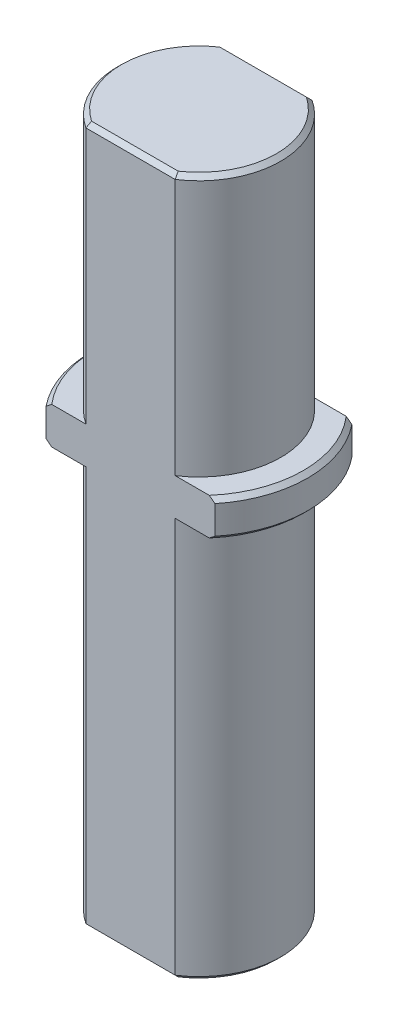
ISO-10303-21;
HEADER;
FILE_DESCRIPTION(('STEP AP214'),'2;1');
FILE_NAME('part.step','',(''),(''),'','','');
FILE_SCHEMA(('AUTOMOTIVE_DESIGN { 1 0 10303 214 1 1 1 1 }'));
ENDSEC;
DATA;
#1=APPLICATION_CONTEXT('core data for automotive mechanical design processes');
#2=APPLICATION_PROTOCOL_DEFINITION('international standard','automotive_design',2000,#1);
#3=PRODUCT_CONTEXT('',#1,'mechanical');
#4=PRODUCT('Part','Part','',(#3));
#5=PRODUCT_RELATED_PRODUCT_CATEGORY('part','',(#4));
#6=PRODUCT_DEFINITION_FORMATION('','',#4);
#7=PRODUCT_DEFINITION_CONTEXT('part definition',#1,'design');
#8=PRODUCT_DEFINITION('design','',#6,#7);
#9=PRODUCT_DEFINITION_SHAPE('','',#8);
#10=(LENGTH_UNIT() NAMED_UNIT(*) SI_UNIT(.MILLI.,.METRE.));
#11=(NAMED_UNIT(*) PLANE_ANGLE_UNIT() SI_UNIT($,.RADIAN.));
#12=(NAMED_UNIT(*) SI_UNIT($,.STERADIAN.) SOLID_ANGLE_UNIT());
#13=UNCERTAINTY_MEASURE_WITH_UNIT(LENGTH_MEASURE(1.E-05),#10,'distance_accuracy_value','');
#14=(GEOMETRIC_REPRESENTATION_CONTEXT(3) GLOBAL_UNCERTAINTY_ASSIGNED_CONTEXT((#13)) GLOBAL_UNIT_ASSIGNED_CONTEXT((#10,
#11,#12)) REPRESENTATION_CONTEXT('',''));
#15=CARTESIAN_POINT('',(0.,0.,0.));
#16=DIRECTION('',(0.,0.,1.));
#17=DIRECTION('',(1.,0.,0.));
#18=AXIS2_PLACEMENT_3D('',#15,#16,#17);
#19=CARTESIAN_POINT('',(0.,64.2,0.));
#20=DIRECTION('',(0.,-1.,0.));
#21=DIRECTION('',(0.,0.,-1.));
#22=AXIS2_PLACEMENT_3D('',#19,#20,#21);
#23=CYLINDRICAL_SURFACE('',#22,7.52);
#24=CARTESIAN_POINT('',(0.,36.8,0.));
#25=DIRECTION('',(0.,1.,0.));
#26=DIRECTION('',(0.,0.,1.));
#27=AXIS2_PLACEMENT_3D('',#24,#25,#26);
#28=CIRCLE('',#27,7.52);
#29=CARTESIAN_POINT('',(4.10614174134308,36.8,6.3));
#30=VERTEX_POINT('',#29);
#31=CARTESIAN_POINT('',(4.10614174134308,36.8,-6.3));
#32=VERTEX_POINT('',#31);
#33=EDGE_CURVE('E224',#30,#32,#28,.T.);
#34=ORIENTED_EDGE('',*,*,#33,.F.);
#35=DIRECTION('',(0.,-1.,0.));
#36=VECTOR('',#35,1.);
#37=CARTESIAN_POINT('',(4.10614174134308,64.2,6.3));
#38=LINE('',#37,#36);
#39=CARTESIAN_POINT('',(4.10614174134308,0.399999999999998,6.3));
#40=VERTEX_POINT('',#39);
#41=EDGE_CURVE('E243',#30,#40,#38,.T.);
#42=ORIENTED_EDGE('',*,*,#41,.T.);
#43=CARTESIAN_POINT('',(0.,0.399999999999998,0.));
#44=DIRECTION('',(0.,1.,0.));
#45=DIRECTION('',(0.,0.,1.));
#46=AXIS2_PLACEMENT_3D('',#43,#44,#45);
#47=CIRCLE('',#46,7.52);
#48=CARTESIAN_POINT('',(4.10614174134308,0.399999999999998,-6.3));
#49=VERTEX_POINT('',#48);
#50=EDGE_CURVE('E248',#40,#49,#47,.T.);
#51=ORIENTED_EDGE('',*,*,#50,.T.);
#52=DIRECTION('',(0.,-1.,0.));
#53=VECTOR('',#52,1.);
#54=CARTESIAN_POINT('',(4.10614174134308,64.2,-6.3));
#55=LINE('',#54,#53);
#56=EDGE_CURVE('E589',#32,#49,#55,.T.);
#57=ORIENTED_EDGE('',*,*,#56,.F.);
#58=EDGE_LOOP('',(#34,#42,#51,#57));
#59=FACE_BOUND('',#58,.T.);
#60=ADVANCED_FACE('F71',(#59),#23,.T.);
#61=CARTESIAN_POINT('',(0.,64.2,0.));
#62=DIRECTION('',(0.,-1.,0.));
#63=DIRECTION('',(0.,0.,-1.));
#64=AXIS2_PLACEMENT_3D('',#61,#62,#63);
#65=CYLINDRICAL_SURFACE('',#64,7.52);
#66=CARTESIAN_POINT('',(0.,36.8,0.));
#67=DIRECTION('',(0.,1.,0.));
#68=DIRECTION('',(0.,0.,1.));
#69=AXIS2_PLACEMENT_3D('',#66,#67,#68);
#70=CIRCLE('',#69,7.52);
#71=CARTESIAN_POINT('',(-4.10614174134308,36.8,-6.3));
#72=VERTEX_POINT('',#71);
#73=CARTESIAN_POINT('',(-4.10614174134308,36.8,6.3));
#74=VERTEX_POINT('',#73);
#75=EDGE_CURVE('E420',#72,#74,#70,.T.);
#76=ORIENTED_EDGE('',*,*,#75,.F.);
#77=DIRECTION('',(0.,-1.,0.));
#78=VECTOR('',#77,1.);
#79=CARTESIAN_POINT('',(-4.10614174134308,64.2,-6.3));
#80=LINE('',#79,#78);
#81=CARTESIAN_POINT('',(-4.10614174134308,0.399999999999998,-6.3));
#82=VERTEX_POINT('',#81);
#83=EDGE_CURVE('E593',#72,#82,#80,.T.);
#84=ORIENTED_EDGE('',*,*,#83,.T.);
#85=CARTESIAN_POINT('',(0.,0.399999999999998,0.));
#86=DIRECTION('',(0.,1.,0.));
#87=DIRECTION('',(0.,0.,1.));
#88=AXIS2_PLACEMENT_3D('',#85,#86,#87);
#89=CIRCLE('',#88,7.52);
#90=CARTESIAN_POINT('',(-4.10614174134308,0.399999999999998,6.3));
#91=VERTEX_POINT('',#90);
#92=EDGE_CURVE('E282',#82,#91,#89,.T.);
#93=ORIENTED_EDGE('',*,*,#92,.T.);
#94=DIRECTION('',(0.,-1.,0.));
#95=VECTOR('',#94,1.);
#96=CARTESIAN_POINT('',(-4.10614174134308,64.2,6.3));
#97=LINE('',#96,#95);
#98=EDGE_CURVE('E360',#74,#91,#97,.T.);
#99=ORIENTED_EDGE('',*,*,#98,.F.);
#100=EDGE_LOOP('',(#76,#84,#93,#99));
#101=FACE_BOUND('',#100,.T.);
#102=ADVANCED_FACE('F503',(#101),#65,.T.);
#103=CARTESIAN_POINT('',(0.,64.2,-6.3));
#104=DIRECTION('',(0.,0.,-1.));
#105=DIRECTION('',(-1.,0.,0.));
#106=AXIS2_PLACEMENT_3D('',#103,#104,#105);
#107=PLANE('',#106);
#108=DIRECTION('',(-1.,0.,0.));
#109=VECTOR('',#108,1.);
#110=CARTESIAN_POINT('',(-7.76595132614157,36.8,-6.3));
#111=LINE('',#110,#109);
#112=CARTESIAN_POINT('',(-7.24361788058979,36.8,-6.3));
#113=VERTEX_POINT('',#112);
#114=EDGE_CURVE('E533',#72,#113,#111,.T.);
#115=ORIENTED_EDGE('',*,*,#114,.T.);
#116=CARTESIAN_POINT('',(-7.24361788058979,36.8,-6.3));
#117=CARTESIAN_POINT('',(-7.33113662389494,36.8660618893734,-6.3));
#118=CARTESIAN_POINT('',(-7.41842379333974,36.9324261756771,-6.3));
#119=CARTESIAN_POINT('',(-7.59253494162887,37.0657595093083,-6.3));
#120=CARTESIAN_POINT('',(-7.67935892070133,37.1327285563379,-6.3));
#121=CARTESIAN_POINT('',(-7.76595132614157,37.2,-6.3));
#122=B_SPLINE_CURVE_WITH_KNOTS('',3,(#116,#117,#118,#119,#120,#121),.UNSPECIFIED.,.F.,.F.,(4,2,
4),(0.,0.32895199652325,0.65790383101915),.UNSPECIFIED.);
#123=CARTESIAN_POINT('',(-7.76595132614157,37.2,-6.3));
#124=VERTEX_POINT('',#123);
#125=EDGE_CURVE('E487',#113,#124,#122,.T.);
#126=ORIENTED_EDGE('',*,*,#125,.T.);
#127=DIRECTION('',(0.,1.,0.));
#128=VECTOR('',#127,1.);
#129=CARTESIAN_POINT('',(-7.76595132614157,36.8,-6.3));
#130=LINE('',#129,#128);
#131=CARTESIAN_POINT('',(-7.76595132614157,39.8,-6.3));
#132=VERTEX_POINT('',#131);
#133=EDGE_CURVE('E225',#124,#132,#130,.T.);
#134=ORIENTED_EDGE('',*,*,#133,.T.);
#135=CARTESIAN_POINT('',(-7.76595132614157,39.8,-6.3));
#136=CARTESIAN_POINT('',(-7.67935892070133,39.8672714436621,-6.3));
#137=CARTESIAN_POINT('',(-7.59253494162887,39.9342404906917,-6.3));
#138=CARTESIAN_POINT('',(-7.41842379333974,40.0675738243229,-6.3));
#139=CARTESIAN_POINT('',(-7.33113662389494,40.1339381106267,-6.3));
#140=CARTESIAN_POINT('',(-7.24361788058978,40.2,-6.3));
#141=B_SPLINE_CURVE_WITH_KNOTS('',3,(#135,#136,#137,#138,#139,#140),.UNSPECIFIED.,.F.,.F.,(4,2,
4),(0.,0.328951834495904,0.657903831019155),.UNSPECIFIED.);
#142=CARTESIAN_POINT('',(-7.24361788058978,40.2,-6.3));
#143=VERTEX_POINT('',#142);
#144=EDGE_CURVE('E89',#132,#143,#141,.T.);
#145=ORIENTED_EDGE('',*,*,#144,.T.);
#146=DIRECTION('',(-1.,0.,0.));
#147=VECTOR('',#146,1.);
#148=CARTESIAN_POINT('',(-7.76595132614157,40.2,-6.3));
#149=LINE('',#148,#147);
#150=CARTESIAN_POINT('',(-4.10614174134308,40.2,-6.3));
#151=VERTEX_POINT('',#150);
#152=EDGE_CURVE('E859',#151,#143,#149,.T.);
#153=ORIENTED_EDGE('',*,*,#152,.F.);
#154=CARTESIAN_POINT('',(-4.10614174134308,63.8,-6.3));
#155=VERTEX_POINT('',#154);
#156=EDGE_CURVE('E857',#155,#151,#80,.T.);
#157=ORIENTED_EDGE('',*,*,#156,.F.);
#158=DIRECTION('',(1.,0.,0.));
#159=VECTOR('',#158,1.);
#160=CARTESIAN_POINT('',(0.,63.8,-6.3));
#161=LINE('',#160,#159);
#162=CARTESIAN_POINT('',(4.10614174134308,63.8,-6.3));
#163=VERTEX_POINT('',#162);
#164=EDGE_CURVE('E271',#155,#163,#161,.T.);
#165=ORIENTED_EDGE('',*,*,#164,.T.);
#166=CARTESIAN_POINT('',(4.10614174134308,40.2,-6.3));
#167=VERTEX_POINT('',#166);
#168=EDGE_CURVE('E251',#163,#167,#55,.T.);
#169=ORIENTED_EDGE('',*,*,#168,.T.);
#170=CARTESIAN_POINT('',(7.24361788058979,40.2,-6.3));
#171=VERTEX_POINT('',#170);
#172=EDGE_CURVE('E218',#171,#167,#149,.T.);
#173=ORIENTED_EDGE('',*,*,#172,.F.);
#174=CARTESIAN_POINT('',(7.24361788058979,40.2,-6.3));
#175=CARTESIAN_POINT('',(7.33113662389493,40.1339381106267,-6.3));
#176=CARTESIAN_POINT('',(7.41842379333974,40.0675738243229,-6.3));
#177=CARTESIAN_POINT('',(7.59253494162887,39.9342404906917,-6.30000000000001));
#178=CARTESIAN_POINT('',(7.67935892070133,39.8672714436621,-6.30000000000001));
#179=CARTESIAN_POINT('',(7.76595132614157,39.8,-6.30000000000001));
#180=B_SPLINE_CURVE_WITH_KNOTS('',3,(#174,#175,#176,#177,#178,#179),.UNSPECIFIED.,.F.,.F.,(4,2,
4),(0.,0.328951996523246,0.657903831019151),.UNSPECIFIED.);
#181=CARTESIAN_POINT('',(7.76595132614157,39.8,-6.3));
#182=VERTEX_POINT('',#181);
#183=EDGE_CURVE('E507',#171,#182,#180,.T.);
#184=ORIENTED_EDGE('',*,*,#183,.T.);
#185=DIRECTION('',(0.,1.,0.));
#186=VECTOR('',#185,1.);
#187=CARTESIAN_POINT('',(7.76595132614157,36.8,-6.3));
#188=LINE('',#187,#186);
#189=CARTESIAN_POINT('',(7.76595132614157,37.2,-6.3));
#190=VERTEX_POINT('',#189);
#191=EDGE_CURVE('E868',#190,#182,#188,.T.);
#192=ORIENTED_EDGE('',*,*,#191,.F.);
#193=CARTESIAN_POINT('',(7.76595132614157,37.2,-6.3));
#194=CARTESIAN_POINT('',(7.67935892070133,37.1327285563379,-6.3));
#195=CARTESIAN_POINT('',(7.59253494162887,37.0657595093083,-6.3));
#196=CARTESIAN_POINT('',(7.41842379333974,36.9324261756771,-6.30000000000001));
#197=CARTESIAN_POINT('',(7.33113662389493,36.8660618893734,-6.30000000000001));
#198=CARTESIAN_POINT('',(7.24361788058978,36.8,-6.30000000000001));
#199=B_SPLINE_CURVE_WITH_KNOTS('',3,(#193,#194,#195,#196,#197,#198),.UNSPECIFIED.,.F.,.F.,(4,2,
4),(0.,0.3289518344959,0.657903831019151),.UNSPECIFIED.);
#200=CARTESIAN_POINT('',(7.24361788058979,36.8,-6.3));
#201=VERTEX_POINT('',#200);
#202=EDGE_CURVE('E96',#190,#201,#199,.T.);
#203=ORIENTED_EDGE('',*,*,#202,.T.);
#204=EDGE_CURVE('E563',#201,#32,#111,.T.);
#205=ORIENTED_EDGE('',*,*,#204,.T.);
#206=ORIENTED_EDGE('',*,*,#56,.T.);
#207=DIRECTION('',(-1.,0.,0.));
#208=VECTOR('',#207,1.);
#209=CARTESIAN_POINT('',(-4.10614174134308,0.399999999999998,-6.3));
#210=LINE('',#209,#208);
#211=EDGE_CURVE('E274',#49,#82,#210,.T.);
#212=ORIENTED_EDGE('',*,*,#211,.T.);
#213=ORIENTED_EDGE('',*,*,#83,.F.);
#214=EDGE_LOOP('',(#115,#126,#134,#145,#153,#157,#165,#169,#173,#184,#192,#203,#205,#206,#212,#213));
#215=FACE_BOUND('',#214,.T.);
#216=ADVANCED_FACE('F498',(#215),#107,.T.);
#217=CARTESIAN_POINT('',(0.,0.,0.));
#218=DIRECTION('',(0.,1.,0.));
#219=DIRECTION('',(0.,0.,1.));
#220=AXIS2_PLACEMENT_3D('',#217,#218,#219);
#221=PLANE('',#220);
#222=DIRECTION('',(1.,0.,0.));
#223=VECTOR('',#222,1.);
#224=CARTESIAN_POINT('',(4.10614174134308,0.,-5.90000000000001));
#225=LINE('',#224,#223);
#226=CARTESIAN_POINT('',(-3.9855238049722,0.,-5.9));
#227=VERTEX_POINT('',#226);
#228=CARTESIAN_POINT('',(3.98552380497219,0.,-5.90000000000001));
#229=VERTEX_POINT('',#228);
#230=EDGE_CURVE('E264',#227,#229,#225,.T.);
#231=ORIENTED_EDGE('',*,*,#230,.T.);
#232=CARTESIAN_POINT('',(0.,0.,0.));
#233=DIRECTION('',(0.,1.,0.));
#234=DIRECTION('',(0.,0.,1.));
#235=AXIS2_PLACEMENT_3D('',#232,#233,#234);
#236=CIRCLE('',#235,7.12);
#237=CARTESIAN_POINT('',(3.98552380497219,0.,5.9));
#238=VERTEX_POINT('',#237);
#239=EDGE_CURVE('E267',#229,#238,#236,.F.);
#240=ORIENTED_EDGE('',*,*,#239,.T.);
#241=DIRECTION('',(-1.,0.,0.));
#242=VECTOR('',#241,1.);
#243=CARTESIAN_POINT('',(0.,0.,5.9));
#244=LINE('',#243,#242);
#245=CARTESIAN_POINT('',(-3.98552380497219,0.,5.9));
#246=VERTEX_POINT('',#245);
#247=EDGE_CURVE('E258',#238,#246,#244,.T.);
#248=ORIENTED_EDGE('',*,*,#247,.T.);
#249=CARTESIAN_POINT('',(0.,0.,0.));
#250=DIRECTION('',(0.,1.,0.));
#251=DIRECTION('',(0.,0.,1.));
#252=AXIS2_PLACEMENT_3D('',#249,#250,#251);
#253=CIRCLE('',#252,7.12);
#254=EDGE_CURVE('E261',#246,#227,#253,.F.);
#255=ORIENTED_EDGE('',*,*,#254,.T.);
#256=EDGE_LOOP('',(#231,#240,#248,#255));
#257=FACE_BOUND('',#256,.T.);
#258=ADVANCED_FACE('F502',(#257),#221,.F.);
#259=CARTESIAN_POINT('',(4.10614174134308,63.8,6.3));
#260=VERTEX_POINT('',#259);
#261=CARTESIAN_POINT('',(4.10614174134308,40.2,6.3));
#262=VERTEX_POINT('',#261);
#263=EDGE_CURVE('E231',#260,#262,#38,.T.);
#264=ORIENTED_EDGE('',*,*,#263,.T.);
#265=CARTESIAN_POINT('',(0.,40.2,0.));
#266=DIRECTION('',(0.,1.,0.));
#267=DIRECTION('',(0.,0.,1.));
#268=AXIS2_PLACEMENT_3D('',#265,#266,#267);
#269=CIRCLE('',#268,7.52);
#270=EDGE_CURVE('E212',#262,#167,#269,.T.);
#271=ORIENTED_EDGE('',*,*,#270,.T.);
#272=ORIENTED_EDGE('',*,*,#168,.F.);
#273=CARTESIAN_POINT('',(0.,63.8,0.));
#274=DIRECTION('',(0.,1.,0.));
#275=DIRECTION('',(0.,0.,1.));
#276=AXIS2_PLACEMENT_3D('',#273,#274,#275);
#277=CIRCLE('',#276,7.52);
#278=EDGE_CURVE('E241',#163,#260,#277,.F.);
#279=ORIENTED_EDGE('',*,*,#278,.T.);
#280=EDGE_LOOP('',(#264,#271,#272,#279));
#281=FACE_BOUND('',#280,.T.);
#282=ADVANCED_FACE('F239',(#281),#23,.T.);
#283=CARTESIAN_POINT('',(0.,64.2,6.3));
#284=DIRECTION('',(0.,0.,-1.));
#285=DIRECTION('',(-1.,0.,0.));
#286=AXIS2_PLACEMENT_3D('',#283,#284,#285);
#287=PLANE('',#286);
#288=DIRECTION('',(0.,1.,0.));
#289=VECTOR('',#288,1.);
#290=CARTESIAN_POINT('',(-7.76595132614157,36.8,6.3));
#291=LINE('',#290,#289);
#292=CARTESIAN_POINT('',(-7.76595132614157,37.2,6.3));
#293=VERTEX_POINT('',#292);
#294=CARTESIAN_POINT('',(-7.76595132614157,39.8,6.3));
#295=VERTEX_POINT('',#294);
#296=EDGE_CURVE('E526',#293,#295,#291,.T.);
#297=ORIENTED_EDGE('',*,*,#296,.F.);
#298=CARTESIAN_POINT('',(-7.76595132614157,37.2,6.3));
#299=CARTESIAN_POINT('',(-7.67935892070133,37.1327285563379,6.3));
#300=CARTESIAN_POINT('',(-7.59253494162887,37.0657595093083,6.3));
#301=CARTESIAN_POINT('',(-7.41842379333974,36.9324261756771,6.3));
#302=CARTESIAN_POINT('',(-7.33113662389494,36.8660618893734,6.3));
#303=CARTESIAN_POINT('',(-7.24361788058979,36.8,6.3));
#304=B_SPLINE_CURVE_WITH_KNOTS('',3,(#298,#299,#300,#301,#302,#303),.UNSPECIFIED.,.F.,.F.,(4,2,
4),(0.,0.328951834495898,0.657903831019146),.UNSPECIFIED.);
#305=CARTESIAN_POINT('',(-7.24361788058979,36.8,6.3));
#306=VERTEX_POINT('',#305);
#307=EDGE_CURVE('E459',#293,#306,#304,.T.);
#308=ORIENTED_EDGE('',*,*,#307,.T.);
#309=DIRECTION('',(1.,0.,0.));
#310=VECTOR('',#309,1.);
#311=CARTESIAN_POINT('',(-7.76595132614157,36.8,6.3));
#312=LINE('',#311,#310);
#313=EDGE_CURVE('E524',#306,#74,#312,.T.);
#314=ORIENTED_EDGE('',*,*,#313,.T.);
#315=ORIENTED_EDGE('',*,*,#98,.T.);
#316=DIRECTION('',(1.,0.,0.));
#317=VECTOR('',#316,1.);
#318=CARTESIAN_POINT('',(0.,0.399999999999998,6.3));
#319=LINE('',#318,#317);
#320=EDGE_CURVE('E289',#91,#40,#319,.T.);
#321=ORIENTED_EDGE('',*,*,#320,.T.);
#322=ORIENTED_EDGE('',*,*,#41,.F.);
#323=CARTESIAN_POINT('',(7.24361788058978,36.8,6.3));
#324=VERTEX_POINT('',#323);
#325=EDGE_CURVE('E534',#30,#324,#312,.T.);
#326=ORIENTED_EDGE('',*,*,#325,.T.);
#327=CARTESIAN_POINT('',(7.24361788058979,36.8,6.3));
#328=CARTESIAN_POINT('',(7.33113662389494,36.8660618893734,6.3));
#329=CARTESIAN_POINT('',(7.41842379333974,36.9324261756771,6.3));
#330=CARTESIAN_POINT('',(7.59253494162887,37.0657595093083,6.3));
#331=CARTESIAN_POINT('',(7.67935892070133,37.1327285563379,6.3));
#332=CARTESIAN_POINT('',(7.76595132614157,37.2,6.3));
#333=B_SPLINE_CURVE_WITH_KNOTS('',3,(#327,#328,#329,#330,#331,#332),.UNSPECIFIED.,.F.,.F.,(4,2,
4),(0.,0.328951996523251,0.657903831019149),.UNSPECIFIED.);
#334=CARTESIAN_POINT('',(7.76595132614157,37.2,6.3));
#335=VERTEX_POINT('',#334);
#336=EDGE_CURVE('E437',#324,#335,#333,.T.);
#337=ORIENTED_EDGE('',*,*,#336,.T.);
#338=DIRECTION('',(0.,1.,0.));
#339=VECTOR('',#338,1.);
#340=CARTESIAN_POINT('',(7.76595132614157,36.8,6.3));
#341=LINE('',#340,#339);
#342=CARTESIAN_POINT('',(7.76595132614157,39.8,6.3));
#343=VERTEX_POINT('',#342);
#344=EDGE_CURVE('E865',#335,#343,#341,.T.);
#345=ORIENTED_EDGE('',*,*,#344,.T.);
#346=CARTESIAN_POINT('',(7.76595132614157,39.8,6.3));
#347=CARTESIAN_POINT('',(7.67935892070133,39.8672714436621,6.3));
#348=CARTESIAN_POINT('',(7.59253494162887,39.9342404906917,6.3));
#349=CARTESIAN_POINT('',(7.41842379333974,40.0675738243229,6.3));
#350=CARTESIAN_POINT('',(7.33113662389494,40.1339381106267,6.3));
#351=CARTESIAN_POINT('',(7.24361788058979,40.2,6.3));
#352=B_SPLINE_CURVE_WITH_KNOTS('',3,(#346,#347,#348,#349,#350,#351),.UNSPECIFIED.,.F.,.F.,(4,2,
4),(0.,0.328951834495904,0.657903831019151),.UNSPECIFIED.);
#353=CARTESIAN_POINT('',(7.24361788058978,40.2,6.3));
#354=VERTEX_POINT('',#353);
#355=EDGE_CURVE('E235',#343,#354,#352,.T.);
#356=ORIENTED_EDGE('',*,*,#355,.T.);
#357=DIRECTION('',(1.,0.,0.));
#358=VECTOR('',#357,1.);
#359=CARTESIAN_POINT('',(-7.76595132614157,40.2,6.3));
#360=LINE('',#359,#358);
#361=EDGE_CURVE('E215',#262,#354,#360,.T.);
#362=ORIENTED_EDGE('',*,*,#361,.F.);
#363=ORIENTED_EDGE('',*,*,#263,.F.);
#364=DIRECTION('',(-1.,0.,0.));
#365=VECTOR('',#364,1.);
#366=CARTESIAN_POINT('',(-4.10614174134308,63.8,6.3));
#367=LINE('',#366,#365);
#368=CARTESIAN_POINT('',(-4.10614174134308,63.8,6.3));
#369=VERTEX_POINT('',#368);
#370=EDGE_CURVE('E286',#260,#369,#367,.T.);
#371=ORIENTED_EDGE('',*,*,#370,.T.);
#372=CARTESIAN_POINT('',(-4.10614174134308,40.2,6.3));
#373=VERTEX_POINT('',#372);
#374=EDGE_CURVE('E591',#369,#373,#97,.T.);
#375=ORIENTED_EDGE('',*,*,#374,.T.);
#376=CARTESIAN_POINT('',(-7.24361788058978,40.2,6.3));
#377=VERTEX_POINT('',#376);
#378=EDGE_CURVE('E237',#377,#373,#360,.T.);
#379=ORIENTED_EDGE('',*,*,#378,.F.);
#380=CARTESIAN_POINT('',(-7.24361788058978,40.2,6.3));
#381=CARTESIAN_POINT('',(-7.33113662389493,40.1339381106267,6.3));
#382=CARTESIAN_POINT('',(-7.41842379333974,40.0675738243229,6.3));
#383=CARTESIAN_POINT('',(-7.59253494162887,39.9342404906917,6.3));
#384=CARTESIAN_POINT('',(-7.67935892070133,39.8672714436621,6.3));
#385=CARTESIAN_POINT('',(-7.76595132614157,39.8,6.3));
#386=B_SPLINE_CURVE_WITH_KNOTS('',3,(#380,#381,#382,#383,#384,#385),.UNSPECIFIED.,.F.,.F.,(4,2,
4),(0.,0.32895199652325,0.657903831019155),.UNSPECIFIED.);
#387=EDGE_CURVE('E452',#377,#295,#386,.T.);
#388=ORIENTED_EDGE('',*,*,#387,.T.);
#389=EDGE_LOOP('',(#297,#308,#314,#315,#321,#322,#326,#337,#345,#356,#362,#363,#371,#375,#379,#388));
#390=FACE_BOUND('',#389,.T.);
#391=ADVANCED_FACE('F230',(#390),#287,.F.);
#392=ORIENTED_EDGE('',*,*,#156,.T.);
#393=CARTESIAN_POINT('',(0.,40.2,0.));
#394=DIRECTION('',(0.,1.,0.));
#395=DIRECTION('',(0.,0.,1.));
#396=AXIS2_PLACEMENT_3D('',#393,#394,#395);
#397=CIRCLE('',#396,7.52);
#398=EDGE_CURVE('E306',#151,#373,#397,.T.);
#399=ORIENTED_EDGE('',*,*,#398,.T.);
#400=ORIENTED_EDGE('',*,*,#374,.F.);
#401=CARTESIAN_POINT('',(0.,63.8,0.));
#402=DIRECTION('',(0.,1.,0.));
#403=DIRECTION('',(0.,0.,1.));
#404=AXIS2_PLACEMENT_3D('',#401,#402,#403);
#405=CIRCLE('',#404,7.52);
#406=EDGE_CURVE('E278',#369,#155,#405,.F.);
#407=ORIENTED_EDGE('',*,*,#406,.T.);
#408=EDGE_LOOP('',(#392,#399,#400,#407));
#409=FACE_BOUND('',#408,.T.);
#410=ADVANCED_FACE('F446',(#409),#65,.T.);
#411=CARTESIAN_POINT('',(0.,64.2,0.));
#412=DIRECTION('',(0.,1.,0.));
#413=DIRECTION('',(0.,0.,1.));
#414=AXIS2_PLACEMENT_3D('',#411,#412,#413);
#415=PLANE('',#414);
#416=DIRECTION('',(-1.,0.,0.));
#417=VECTOR('',#416,1.);
#418=CARTESIAN_POINT('',(0.,64.2,-5.90000000000001));
#419=LINE('',#418,#417);
#420=CARTESIAN_POINT('',(3.98552380497219,64.2,-5.90000000000001));
#421=VERTEX_POINT('',#420);
#422=CARTESIAN_POINT('',(-3.9855238049722,64.2,-5.90000000000001));
#423=VERTEX_POINT('',#422);
#424=EDGE_CURVE('E299',#421,#423,#419,.T.);
#425=ORIENTED_EDGE('',*,*,#424,.T.);
#426=CARTESIAN_POINT('',(0.,64.2,0.));
#427=DIRECTION('',(0.,1.,0.));
#428=DIRECTION('',(0.,0.,1.));
#429=AXIS2_PLACEMENT_3D('',#426,#427,#428);
#430=CIRCLE('',#429,7.12000000000001);
#431=CARTESIAN_POINT('',(-3.9855238049722,64.2,5.90000000000001));
#432=VERTEX_POINT('',#431);
#433=EDGE_CURVE('E302',#423,#432,#430,.T.);
#434=ORIENTED_EDGE('',*,*,#433,.T.);
#435=DIRECTION('',(1.,0.,0.));
#436=VECTOR('',#435,1.);
#437=CARTESIAN_POINT('',(4.10614174134308,64.2,5.90000000000001));
#438=LINE('',#437,#436);
#439=CARTESIAN_POINT('',(3.98552380497219,64.2,5.90000000000001));
#440=VERTEX_POINT('',#439);
#441=EDGE_CURVE('E293',#432,#440,#438,.T.);
#442=ORIENTED_EDGE('',*,*,#441,.T.);
#443=CARTESIAN_POINT('',(0.,64.2,0.));
#444=DIRECTION('',(0.,1.,0.));
#445=DIRECTION('',(0.,0.,1.));
#446=AXIS2_PLACEMENT_3D('',#443,#444,#445);
#447=CIRCLE('',#446,7.12000000000001);
#448=EDGE_CURVE('E296',#440,#421,#447,.T.);
#449=ORIENTED_EDGE('',*,*,#448,.T.);
#450=EDGE_LOOP('',(#425,#434,#442,#449));
#451=FACE_BOUND('',#450,.T.);
#452=ADVANCED_FACE('F596',(#451),#415,.T.);
#453=CARTESIAN_POINT('',(0.,0.399999999999998,0.));
#454=DIRECTION('',(0.,1.,0.));
#455=DIRECTION('',(0.,0.,1.));
#456=AXIS2_PLACEMENT_3D('',#453,#454,#455);
#457=CONICAL_SURFACE('',#456,7.52,0.785398163397448);
#458=CARTESIAN_POINT('',(-4.10614174134308,0.399999999999998,-6.3));
#459=CARTESIAN_POINT('',(-4.08632537102107,0.333290123482191,-6.23329012348219));
#460=CARTESIAN_POINT('',(-4.06636569180612,0.266601853993037,-6.16660185399304));
#461=CARTESIAN_POINT('',(-4.02615971305202,0.133268520654248,-6.03326852065425));
#462=CARTESIAN_POINT('',(-4.00591341347667,0.0666234568100697,-5.96662345681007));
#463=CARTESIAN_POINT('',(-3.9855238049722,0.,-5.9));
#464=B_SPLINE_CURVE_WITH_KNOTS('',3,(#458,#459,#460,#461,#462,#463),.UNSPECIFIED.,.F.,.F.,(4,2,
4),(0.,0.289201234996531,0.578402506509562),.UNSPECIFIED.);
#465=EDGE_CURVE('E361',#227,#82,#464,.F.);
#466=ORIENTED_EDGE('',*,*,#465,.F.);
#467=ORIENTED_EDGE('',*,*,#254,.F.);
#468=CARTESIAN_POINT('',(-4.10614174134308,0.399999999999998,6.3));
#469=CARTESIAN_POINT('',(-4.08632537102107,0.333290123482191,6.2332901234822));
#470=CARTESIAN_POINT('',(-4.06636569180612,0.266601853993036,6.16660185399304));
#471=CARTESIAN_POINT('',(-4.02615971305202,0.133268520654246,6.03326852065425));
#472=CARTESIAN_POINT('',(-4.00591341347667,0.0666234568100681,5.96662345681007));
#473=CARTESIAN_POINT('',(-3.9855238049722,0.,5.9));
#474=B_SPLINE_CURVE_WITH_KNOTS('',3,(#468,#469,#470,#471,#472,#473),.UNSPECIFIED.,.F.,.F.,(4,2,
4),(0.,0.289201234996532,0.578402506509564),.UNSPECIFIED.);
#475=EDGE_CURVE('E352',#91,#246,#474,.T.);
#476=ORIENTED_EDGE('',*,*,#475,.F.);
#477=ORIENTED_EDGE('',*,*,#92,.F.);
#478=EDGE_LOOP('',(#466,#467,#476,#477));
#479=FACE_BOUND('',#478,.T.);
#480=ADVANCED_FACE('F346',(#479),#457,.T.);
#481=CARTESIAN_POINT('',(0.,0.399999999999998,6.3));
#482=DIRECTION('',(0.,0.707106781186548,-0.707106781186548));
#483=DIRECTION('',(1.,0.,0.));
#484=AXIS2_PLACEMENT_3D('',#481,#482,#483);
#485=PLANE('',#484);
#486=ORIENTED_EDGE('',*,*,#475,.T.);
#487=ORIENTED_EDGE('',*,*,#247,.F.);
#488=CARTESIAN_POINT('',(3.98552380497219,0.,5.9));
#489=CARTESIAN_POINT('',(4.00591341347666,0.0666234568100693,5.96662345681007));
#490=CARTESIAN_POINT('',(4.02615971305201,0.133268520654247,6.03326852065425));
#491=CARTESIAN_POINT('',(4.06636569180612,0.266601853993035,6.16660185399304));
#492=CARTESIAN_POINT('',(4.08632537102107,0.33329012348219,6.23329012348219));
#493=CARTESIAN_POINT('',(4.10614174134309,0.399999999999996,6.3));
#494=B_SPLINE_CURVE_WITH_KNOTS('',3,(#488,#489,#490,#491,#492,#493),.UNSPECIFIED.,.F.,.F.,(4,2,
4),(0.,0.289201271513033,0.578402506509564),.UNSPECIFIED.);
#495=EDGE_CURVE('E317',#40,#238,#494,.F.);
#496=ORIENTED_EDGE('',*,*,#495,.F.);
#497=ORIENTED_EDGE('',*,*,#320,.F.);
#498=EDGE_LOOP('',(#486,#487,#496,#497));
#499=FACE_BOUND('',#498,.T.);
#500=ADVANCED_FACE('F338',(#499),#485,.F.);
#501=CARTESIAN_POINT('',(0.,0.,-5.9));
#502=DIRECTION('',(0.,-0.707106781186548,-0.707106781186548));
#503=DIRECTION('',(-1.,0.,0.));
#504=AXIS2_PLACEMENT_3D('',#501,#502,#503);
#505=PLANE('',#504);
#506=ORIENTED_EDGE('',*,*,#465,.T.);
#507=ORIENTED_EDGE('',*,*,#211,.F.);
#508=CARTESIAN_POINT('',(4.10614174134308,0.399999999999998,-6.3));
#509=CARTESIAN_POINT('',(4.08632537102106,0.333290123482191,-6.2332901234822));
#510=CARTESIAN_POINT('',(4.06636569180612,0.266601853993036,-6.16660185399304));
#511=CARTESIAN_POINT('',(4.02615971305201,0.133268520654247,-6.03326852065425));
#512=CARTESIAN_POINT('',(4.00591341347666,0.0666234568100685,-5.96662345681007));
#513=CARTESIAN_POINT('',(3.98552380497219,0.,-5.9));
#514=B_SPLINE_CURVE_WITH_KNOTS('',3,(#508,#509,#510,#511,#512,#513),.UNSPECIFIED.,.F.,.F.,(4,2,
4),(0.,0.289201234996532,0.578402506509564),.UNSPECIFIED.);
#515=EDGE_CURVE('E307',#229,#49,#514,.F.);
#516=ORIENTED_EDGE('',*,*,#515,.F.);
#517=ORIENTED_EDGE('',*,*,#230,.F.);
#518=EDGE_LOOP('',(#506,#507,#516,#517));
#519=FACE_BOUND('',#518,.T.);
#520=ADVANCED_FACE('F326',(#519),#505,.T.);
#521=CARTESIAN_POINT('',(0.,0.399999999999998,0.));
#522=DIRECTION('',(0.,1.,0.));
#523=DIRECTION('',(0.,0.,1.));
#524=AXIS2_PLACEMENT_3D('',#521,#522,#523);
#525=CONICAL_SURFACE('',#524,7.52,0.785398163397448);
#526=ORIENTED_EDGE('',*,*,#495,.T.);
#527=ORIENTED_EDGE('',*,*,#239,.F.);
#528=ORIENTED_EDGE('',*,*,#515,.T.);
#529=ORIENTED_EDGE('',*,*,#50,.F.);
#530=EDGE_LOOP('',(#526,#527,#528,#529));
#531=FACE_BOUND('',#530,.T.);
#532=ADVANCED_FACE('F330',(#531),#525,.T.);
#533=CARTESIAN_POINT('',(0.,64.2,0.));
#534=DIRECTION('',(0.,-1.,0.));
#535=DIRECTION('',(0.,0.,-1.));
#536=AXIS2_PLACEMENT_3D('',#533,#534,#535);
#537=CONICAL_SURFACE('',#536,7.12000000000001,0.78539816339744);
#538=CARTESIAN_POINT('',(4.10614174134308,63.8,6.3));
#539=CARTESIAN_POINT('',(4.08632537102107,63.8667098765178,6.2332901234822));
#540=CARTESIAN_POINT('',(4.06636569180612,63.933398146007,6.16660185399305));
#541=CARTESIAN_POINT('',(4.02615971305202,64.0667314793458,6.03326852065426));
#542=CARTESIAN_POINT('',(4.00591341347667,64.1333765431899,5.96662345681008));
#543=CARTESIAN_POINT('',(3.9855238049722,64.2,5.90000000000001));
#544=B_SPLINE_CURVE_WITH_KNOTS('',3,(#538,#539,#540,#541,#542,#543),.UNSPECIFIED.,.F.,.F.,(4,2,
4),(0.,0.289201234996523,0.57840250650956),.UNSPECIFIED.);
#545=EDGE_CURVE('E412',#260,#440,#544,.T.);
#546=ORIENTED_EDGE('',*,*,#545,.F.);
#547=ORIENTED_EDGE('',*,*,#278,.F.);
#548=CARTESIAN_POINT('',(4.10614174134308,63.8,-6.3));
#549=CARTESIAN_POINT('',(4.08632537102106,63.8667098765178,-6.2332901234822));
#550=CARTESIAN_POINT('',(4.06636569180612,63.933398146007,-6.16660185399305));
#551=CARTESIAN_POINT('',(4.02615971305201,64.0667314793458,-6.03326852065426));
#552=CARTESIAN_POINT('',(4.00591341347667,64.1333765431899,-5.96662345681008));
#553=CARTESIAN_POINT('',(3.98552380497219,64.2,-5.90000000000001));
#554=B_SPLINE_CURVE_WITH_KNOTS('',3,(#548,#549,#550,#551,#552,#553),.UNSPECIFIED.,.F.,.F.,(4,2,
4),(0.,0.289201234996523,0.57840250650956),.UNSPECIFIED.);
#555=EDGE_CURVE('E318',#421,#163,#554,.F.);
#556=ORIENTED_EDGE('',*,*,#555,.F.);
#557=ORIENTED_EDGE('',*,*,#448,.F.);
#558=EDGE_LOOP('',(#546,#547,#556,#557));
#559=FACE_BOUND('',#558,.T.);
#560=ADVANCED_FACE('F336',(#559),#537,.T.);
#561=CARTESIAN_POINT('',(0.,63.8,-6.3));
#562=DIRECTION('',(0.,-0.707106781186541,0.707106781186554));
#563=DIRECTION('',(1.,0.,0.));
#564=AXIS2_PLACEMENT_3D('',#561,#562,#563);
#565=PLANE('',#564);
#566=ORIENTED_EDGE('',*,*,#555,.T.);
#567=ORIENTED_EDGE('',*,*,#164,.F.);
#568=CARTESIAN_POINT('',(-4.10614174134308,63.8,-6.3));
#569=CARTESIAN_POINT('',(-4.08632537102107,63.8667098765178,-6.2332901234822));
#570=CARTESIAN_POINT('',(-4.06636569180612,63.933398146007,-6.16660185399304));
#571=CARTESIAN_POINT('',(-4.02615971305202,64.0667314793458,-6.03326852065426));
#572=CARTESIAN_POINT('',(-4.00591341347667,64.1333765431899,-5.96662345681008));
#573=CARTESIAN_POINT('',(-3.9855238049722,64.2,-5.9));
#574=B_SPLINE_CURVE_WITH_KNOTS('',3,(#568,#569,#570,#571,#572,#573),.UNSPECIFIED.,.F.,.F.,(4,2,
4),(0.,0.289201234996523,0.578402506509561),.UNSPECIFIED.);
#575=EDGE_CURVE('E374',#423,#155,#574,.F.);
#576=ORIENTED_EDGE('',*,*,#575,.F.);
#577=ORIENTED_EDGE('',*,*,#424,.F.);
#578=EDGE_LOOP('',(#566,#567,#576,#577));
#579=FACE_BOUND('',#578,.T.);
#580=ADVANCED_FACE('F393',(#579),#565,.F.);
#581=CARTESIAN_POINT('',(0.,64.2,5.90000000000001));
#582=DIRECTION('',(0.,0.707106781186541,0.707106781186554));
#583=DIRECTION('',(-1.,0.,0.));
#584=AXIS2_PLACEMENT_3D('',#581,#582,#583);
#585=PLANE('',#584);
#586=ORIENTED_EDGE('',*,*,#545,.T.);
#587=ORIENTED_EDGE('',*,*,#441,.F.);
#588=CARTESIAN_POINT('',(-3.9855238049722,64.2,5.90000000000001));
#589=CARTESIAN_POINT('',(-4.00591341347667,64.1333765431899,5.96662345681008));
#590=CARTESIAN_POINT('',(-4.02615971305202,64.0667314793458,6.03326852065426));
#591=CARTESIAN_POINT('',(-4.06636569180612,63.933398146007,6.16660185399305));
#592=CARTESIAN_POINT('',(-4.08632537102107,63.8667098765178,6.2332901234822));
#593=CARTESIAN_POINT('',(-4.10614174134309,63.8,6.30000000000001));
#594=B_SPLINE_CURVE_WITH_KNOTS('',3,(#588,#589,#590,#591,#592,#593),.UNSPECIFIED.,.F.,.F.,(4,2,
4),(0.,0.289201271513037,0.578402506509564),.UNSPECIFIED.);
#595=EDGE_CURVE('E366',#369,#432,#594,.F.);
#596=ORIENTED_EDGE('',*,*,#595,.F.);
#597=ORIENTED_EDGE('',*,*,#370,.F.);
#598=EDGE_LOOP('',(#586,#587,#596,#597));
#599=FACE_BOUND('',#598,.T.);
#600=ADVANCED_FACE('F382',(#599),#585,.T.);
#601=CARTESIAN_POINT('',(0.,64.2,0.));
#602=DIRECTION('',(0.,-1.,0.));
#603=DIRECTION('',(0.,0.,-1.));
#604=AXIS2_PLACEMENT_3D('',#601,#602,#603);
#605=CONICAL_SURFACE('',#604,7.12000000000001,0.78539816339744);
#606=ORIENTED_EDGE('',*,*,#575,.T.);
#607=ORIENTED_EDGE('',*,*,#406,.F.);
#608=ORIENTED_EDGE('',*,*,#595,.T.);
#609=ORIENTED_EDGE('',*,*,#433,.F.);
#610=EDGE_LOOP('',(#606,#607,#608,#609));
#611=FACE_BOUND('',#610,.T.);
#612=ADVANCED_FACE('F385',(#611),#605,.T.);
#613=CARTESIAN_POINT('',(0.,36.8,0.));
#614=DIRECTION('',(0.,1.,0.));
#615=DIRECTION('',(0.,0.,1.));
#616=AXIS2_PLACEMENT_3D('',#613,#614,#615);
#617=CYLINDRICAL_SURFACE('',#616,10.);
#618=ORIENTED_EDGE('',*,*,#133,.F.);
#619=CARTESIAN_POINT('',(0.,37.2,0.));
#620=DIRECTION('',(0.,1.,0.));
#621=DIRECTION('',(0.,0.,1.));
#622=AXIS2_PLACEMENT_3D('',#619,#620,#621);
#623=CIRCLE('',#622,10.);
#624=EDGE_CURVE('E427',#124,#293,#623,.T.);
#625=ORIENTED_EDGE('',*,*,#624,.T.);
#626=ORIENTED_EDGE('',*,*,#296,.T.);
#627=CARTESIAN_POINT('',(0.,39.8,0.));
#628=DIRECTION('',(0.,1.,0.));
#629=DIRECTION('',(0.,0.,1.));
#630=AXIS2_PLACEMENT_3D('',#627,#628,#629);
#631=CIRCLE('',#630,10.);
#632=EDGE_CURVE('E424',#295,#132,#631,.F.);
#633=ORIENTED_EDGE('',*,*,#632,.T.);
#634=EDGE_LOOP('',(#618,#625,#626,#633));
#635=FACE_BOUND('',#634,.T.);
#636=ADVANCED_FACE('F391',(#635),#617,.T.);
#637=CARTESIAN_POINT('',(0.,36.8,0.));
#638=DIRECTION('',(0.,1.,0.));
#639=DIRECTION('',(0.,0.,1.));
#640=AXIS2_PLACEMENT_3D('',#637,#638,#639);
#641=PLANE('',#640);
#642=ORIENTED_EDGE('',*,*,#313,.F.);
#643=CARTESIAN_POINT('',(0.,36.8,0.));
#644=DIRECTION('',(0.,1.,0.));
#645=DIRECTION('',(0.,0.,1.));
#646=AXIS2_PLACEMENT_3D('',#643,#644,#645);
#647=CIRCLE('',#646,9.6);
#648=EDGE_CURVE('E514',#306,#113,#647,.F.);
#649=ORIENTED_EDGE('',*,*,#648,.T.);
#650=ORIENTED_EDGE('',*,*,#114,.F.);
#651=ORIENTED_EDGE('',*,*,#75,.T.);
#652=EDGE_LOOP('',(#642,#649,#650,#651));
#653=FACE_BOUND('',#652,.T.);
#654=ADVANCED_FACE('F529',(#653),#641,.F.);
#655=CARTESIAN_POINT('',(0.,40.2,0.));
#656=DIRECTION('',(0.,1.,0.));
#657=DIRECTION('',(0.,0.,1.));
#658=AXIS2_PLACEMENT_3D('',#655,#656,#657);
#659=PLANE('',#658);
#660=ORIENTED_EDGE('',*,*,#152,.T.);
#661=CARTESIAN_POINT('',(0.,40.2,0.));
#662=DIRECTION('',(0.,1.,0.));
#663=DIRECTION('',(0.,0.,1.));
#664=AXIS2_PLACEMENT_3D('',#661,#662,#663);
#665=CIRCLE('',#664,9.6);
#666=EDGE_CURVE('E539',#143,#377,#665,.T.);
#667=ORIENTED_EDGE('',*,*,#666,.T.);
#668=ORIENTED_EDGE('',*,*,#378,.T.);
#669=ORIENTED_EDGE('',*,*,#398,.F.);
#670=EDGE_LOOP('',(#660,#667,#668,#669));
#671=FACE_BOUND('',#670,.T.);
#672=ADVANCED_FACE('F616',(#671),#659,.T.);
#673=ORIENTED_EDGE('',*,*,#204,.F.);
#674=CARTESIAN_POINT('',(0.,36.8,0.));
#675=DIRECTION('',(0.,1.,0.));
#676=DIRECTION('',(0.,0.,1.));
#677=AXIS2_PLACEMENT_3D('',#674,#675,#676);
#678=CIRCLE('',#677,9.6);
#679=EDGE_CURVE('E82',#201,#324,#678,.F.);
#680=ORIENTED_EDGE('',*,*,#679,.T.);
#681=ORIENTED_EDGE('',*,*,#325,.F.);
#682=ORIENTED_EDGE('',*,*,#33,.T.);
#683=EDGE_LOOP('',(#673,#680,#681,#682));
#684=FACE_BOUND('',#683,.T.);
#685=ADVANCED_FACE('F560',(#684),#641,.F.);
#686=ORIENTED_EDGE('',*,*,#361,.T.);
#687=CARTESIAN_POINT('',(0.,40.2,0.));
#688=DIRECTION('',(0.,1.,0.));
#689=DIRECTION('',(0.,0.,1.));
#690=AXIS2_PLACEMENT_3D('',#687,#688,#689);
#691=CIRCLE('',#690,9.6);
#692=EDGE_CURVE('E12',#354,#171,#691,.T.);
#693=ORIENTED_EDGE('',*,*,#692,.T.);
#694=ORIENTED_EDGE('',*,*,#172,.T.);
#695=ORIENTED_EDGE('',*,*,#270,.F.);
#696=EDGE_LOOP('',(#686,#693,#694,#695));
#697=FACE_BOUND('',#696,.T.);
#698=ADVANCED_FACE('F214',(#697),#659,.T.);
#699=CARTESIAN_POINT('',(0.,36.8,0.));
#700=DIRECTION('',(0.,1.,0.));
#701=DIRECTION('',(0.,0.,1.));
#702=AXIS2_PLACEMENT_3D('',#699,#700,#701);
#703=CYLINDRICAL_SURFACE('',#702,10.);
#704=ORIENTED_EDGE('',*,*,#344,.F.);
#705=CARTESIAN_POINT('',(0.,37.2,0.));
#706=DIRECTION('',(0.,1.,0.));
#707=DIRECTION('',(0.,0.,1.));
#708=AXIS2_PLACEMENT_3D('',#705,#706,#707);
#709=CIRCLE('',#708,10.);
#710=EDGE_CURVE('E549',#335,#190,#709,.T.);
#711=ORIENTED_EDGE('',*,*,#710,.T.);
#712=ORIENTED_EDGE('',*,*,#191,.T.);
#713=CARTESIAN_POINT('',(0.,39.8,0.));
#714=DIRECTION('',(0.,1.,0.));
#715=DIRECTION('',(0.,0.,1.));
#716=AXIS2_PLACEMENT_3D('',#713,#714,#715);
#717=CIRCLE('',#716,10.);
#718=EDGE_CURVE('E543',#182,#343,#717,.F.);
#719=ORIENTED_EDGE('',*,*,#718,.T.);
#720=EDGE_LOOP('',(#704,#711,#712,#719));
#721=FACE_BOUND('',#720,.T.);
#722=ADVANCED_FACE('F612',(#721),#703,.T.);
#723=CARTESIAN_POINT('',(0.,37.2,0.));
#724=DIRECTION('',(0.,1.,0.));
#725=DIRECTION('',(0.,0.,1.));
#726=AXIS2_PLACEMENT_3D('',#723,#724,#725);
#727=CONICAL_SURFACE('',#726,10.,0.785398163397455);
#728=ORIENTED_EDGE('',*,*,#125,.F.);
#729=ORIENTED_EDGE('',*,*,#648,.F.);
#730=ORIENTED_EDGE('',*,*,#307,.F.);
#731=ORIENTED_EDGE('',*,*,#624,.F.);
#732=EDGE_LOOP('',(#728,#729,#730,#731));
#733=FACE_BOUND('',#732,.T.);
#734=ADVANCED_FACE('F474',(#733),#727,.T.);
#735=CARTESIAN_POINT('',(0.,40.2,0.));
#736=DIRECTION('',(0.,-1.,0.));
#737=DIRECTION('',(0.,0.,-1.));
#738=AXIS2_PLACEMENT_3D('',#735,#736,#737);
#739=CONICAL_SURFACE('',#738,9.6,0.785398163397446);
#740=ORIENTED_EDGE('',*,*,#144,.F.);
#741=ORIENTED_EDGE('',*,*,#632,.F.);
#742=ORIENTED_EDGE('',*,*,#387,.F.);
#743=ORIENTED_EDGE('',*,*,#666,.F.);
#744=EDGE_LOOP('',(#740,#741,#742,#743));
#745=FACE_BOUND('',#744,.T.);
#746=ADVANCED_FACE('F466',(#745),#739,.T.);
#747=CARTESIAN_POINT('',(0.,37.2,0.));
#748=DIRECTION('',(0.,1.,0.));
#749=DIRECTION('',(0.,0.,1.));
#750=AXIS2_PLACEMENT_3D('',#747,#748,#749);
#751=CONICAL_SURFACE('',#750,10.,0.785398163397455);
#752=ORIENTED_EDGE('',*,*,#336,.F.);
#753=ORIENTED_EDGE('',*,*,#679,.F.);
#754=ORIENTED_EDGE('',*,*,#202,.F.);
#755=ORIENTED_EDGE('',*,*,#710,.F.);
#756=EDGE_LOOP('',(#752,#753,#754,#755));
#757=FACE_BOUND('',#756,.T.);
#758=ADVANCED_FACE('F473',(#757),#751,.T.);
#759=CARTESIAN_POINT('',(0.,40.2,0.));
#760=DIRECTION('',(0.,-1.,0.));
#761=DIRECTION('',(0.,0.,-1.));
#762=AXIS2_PLACEMENT_3D('',#759,#760,#761);
#763=CONICAL_SURFACE('',#762,9.6,0.785398163397446);
#764=ORIENTED_EDGE('',*,*,#355,.F.);
#765=ORIENTED_EDGE('',*,*,#718,.F.);
#766=ORIENTED_EDGE('',*,*,#183,.F.);
#767=ORIENTED_EDGE('',*,*,#692,.F.);
#768=EDGE_LOOP('',(#764,#765,#766,#767));
#769=FACE_BOUND('',#768,.T.);
#770=ADVANCED_FACE('F74',(#769),#763,.T.);
#771=CLOSED_SHELL('',(#60,#102,#216,#258,#282,#391,#410,#452,#480,#500,#520,#532,#560,#580,#600,
#612,#636,#654,#672,#685,#698,#722,#734,#746,#758,#770));
#772=MANIFOLD_SOLID_BREP('B2',#771);
#773=ADVANCED_BREP_SHAPE_REPRESENTATION('',(#18,#772),#14);
#774=SHAPE_DEFINITION_REPRESENTATION(#9,#773);
ENDSEC;
END-ISO-10303-21;
